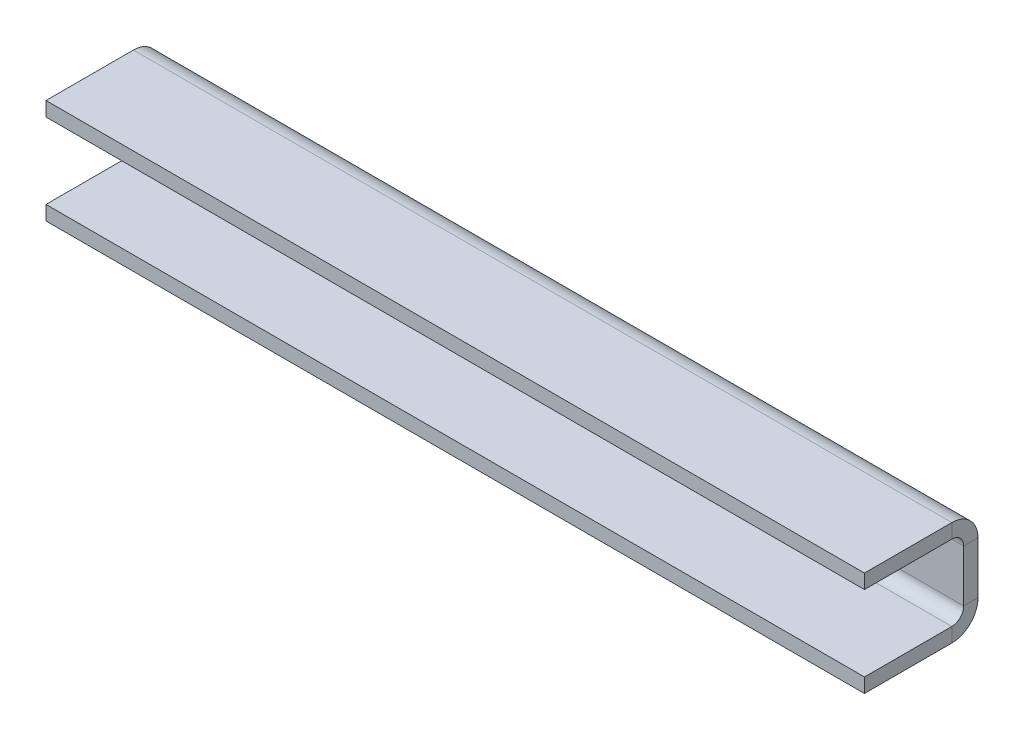
ISO-10303-21;
HEADER;
FILE_DESCRIPTION(('STEP AP214'),'2;1');
FILE_NAME('part.step','',(''),(''),'','','');
FILE_SCHEMA(('AUTOMOTIVE_DESIGN { 1 0 10303 214 1 1 1 1 }'));
ENDSEC;
DATA;
#1=APPLICATION_CONTEXT('core data for automotive mechanical design processes');
#2=APPLICATION_PROTOCOL_DEFINITION('international standard','automotive_design',2000,#1);
#3=PRODUCT_CONTEXT('',#1,'mechanical');
#4=PRODUCT('Part','Part','',(#3));
#5=PRODUCT_RELATED_PRODUCT_CATEGORY('part','',(#4));
#6=PRODUCT_DEFINITION_FORMATION('','',#4);
#7=PRODUCT_DEFINITION_CONTEXT('part definition',#1,'design');
#8=PRODUCT_DEFINITION('design','',#6,#7);
#9=PRODUCT_DEFINITION_SHAPE('','',#8);
#10=(LENGTH_UNIT() NAMED_UNIT(*) SI_UNIT(.MILLI.,.METRE.));
#11=(NAMED_UNIT(*) PLANE_ANGLE_UNIT() SI_UNIT($,.RADIAN.));
#12=(NAMED_UNIT(*) SI_UNIT($,.STERADIAN.) SOLID_ANGLE_UNIT());
#13=UNCERTAINTY_MEASURE_WITH_UNIT(LENGTH_MEASURE(1.E-05),#10,'distance_accuracy_value','');
#14=(GEOMETRIC_REPRESENTATION_CONTEXT(3) GLOBAL_UNCERTAINTY_ASSIGNED_CONTEXT((#13)) GLOBAL_UNIT_ASSIGNED_CONTEXT((#10,
#11,#12)) REPRESENTATION_CONTEXT('',''));
#15=CARTESIAN_POINT('',(0.,0.,0.));
#16=DIRECTION('',(0.,0.,1.));
#17=DIRECTION('',(1.,0.,0.));
#18=AXIS2_PLACEMENT_3D('',#15,#16,#17);
#19=CARTESIAN_POINT('',(0.,0.,0.));
#20=DIRECTION('',(0.,0.,-1.));
#21=DIRECTION('',(-1.,0.,0.));
#22=AXIS2_PLACEMENT_3D('',#19,#20,#21);
#23=PLANE('',#22);
#24=CARTESIAN_POINT('',(12.7,0.,0.));
#25=DIRECTION('',(0.,0.,-1.));
#26=DIRECTION('',(-1.,0.,0.));
#27=AXIS2_PLACEMENT_3D('',#24,#25,#26);
#28=CIRCLE('',#27,1.27);
#29=CARTESIAN_POINT('',(11.43,0.,0.));
#30=VERTEX_POINT('',#29);
#31=EDGE_CURVE('E332',#30,#30,#28,.T.);
#32=ORIENTED_EDGE('',*,*,#31,.T.);
#33=EDGE_LOOP('',(#32));
#34=FACE_BOUND('',#33,.T.);
#35=CARTESIAN_POINT('',(-12.7,0.,0.));
#36=DIRECTION('',(0.,0.,-1.));
#37=DIRECTION('',(-1.,0.,0.));
#38=AXIS2_PLACEMENT_3D('',#35,#36,#37);
#39=CIRCLE('',#38,1.27);
#40=CARTESIAN_POINT('',(-13.97,0.,0.));
#41=VERTEX_POINT('',#40);
#42=EDGE_CURVE('E185',#41,#41,#39,.T.);
#43=ORIENTED_EDGE('',*,*,#42,.T.);
#44=EDGE_LOOP('',(#43));
#45=FACE_BOUND('',#44,.T.);
#46=DIRECTION('',(0.,-1.,0.));
#47=VECTOR('',#46,1.);
#48=CARTESIAN_POINT('',(-25.4,-8.89,0.));
#49=LINE('',#48,#47);
#50=CARTESIAN_POINT('',(-25.4,1.61236622921128,0.));
#51=VERTEX_POINT('',#50);
#52=CARTESIAN_POINT('',(-25.4,-1.61236622921127,0.));
#53=VERTEX_POINT('',#52);
#54=EDGE_CURVE('E80',#51,#53,#49,.T.);
#55=ORIENTED_EDGE('',*,*,#54,.T.);
#56=DIRECTION('',(1.,0.,0.));
#57=VECTOR('',#56,1.);
#58=CARTESIAN_POINT('',(0.,-1.61236622921127,0.));
#59=LINE('',#58,#57);
#60=CARTESIAN_POINT('',(25.4,-1.61236622921127,0.));
#61=VERTEX_POINT('',#60);
#62=EDGE_CURVE('E72',#53,#61,#59,.T.);
#63=ORIENTED_EDGE('',*,*,#62,.T.);
#64=DIRECTION('',(0.,1.,0.));
#65=VECTOR('',#64,1.);
#66=CARTESIAN_POINT('',(25.4,-8.89,0.));
#67=LINE('',#66,#65);
#68=CARTESIAN_POINT('',(25.4,1.61236622921127,0.));
#69=VERTEX_POINT('',#68);
#70=EDGE_CURVE('E88',#61,#69,#67,.T.);
#71=ORIENTED_EDGE('',*,*,#70,.T.);
#72=DIRECTION('',(1.,0.,0.));
#73=VECTOR('',#72,1.);
#74=CARTESIAN_POINT('',(0.,1.61236622921127,0.));
#75=LINE('',#74,#73);
#76=EDGE_CURVE('E208',#51,#69,#75,.T.);
#77=ORIENTED_EDGE('',*,*,#76,.F.);
#78=EDGE_LOOP('',(#55,#63,#71,#77));
#79=FACE_BOUND('',#78,.T.);
#80=ADVANCED_FACE('F63',(#34,#45,#79),#23,.F.);
#81=CARTESIAN_POINT('',(0.,2.34896622921128,-2.73103377078873));
#82=DIRECTION('',(0.,1.,0.));
#83=DIRECTION('',(-1.,0.,0.));
#84=AXIS2_PLACEMENT_3D('',#81,#82,#83);
#85=PLANE('',#84);
#86=DIRECTION('',(0.,0.,-1.));
#87=VECTOR('',#86,1.);
#88=CARTESIAN_POINT('',(-25.4,2.34896622921131,-11.6210337707887));
#89=LINE('',#88,#87);
#90=CARTESIAN_POINT('',(-25.4,2.34896622921125,6.15896622921127));
#91=VERTEX_POINT('',#90);
#92=CARTESIAN_POINT('',(-25.4,2.34896622921128,0.736599999999997));
#93=VERTEX_POINT('',#92);
#94=EDGE_CURVE('E232',#91,#93,#89,.T.);
#95=ORIENTED_EDGE('',*,*,#94,.T.);
#96=DIRECTION('',(1.,0.,0.));
#97=VECTOR('',#96,1.);
#98=CARTESIAN_POINT('',(0.,2.34896622921128,0.736599999999997));
#99=LINE('',#98,#97);
#100=CARTESIAN_POINT('',(25.4,2.34896622921128,0.736600000000011));
#101=VERTEX_POINT('',#100);
#102=EDGE_CURVE('E245',#93,#101,#99,.T.);
#103=ORIENTED_EDGE('',*,*,#102,.T.);
#104=DIRECTION('',(0.,0.,1.));
#105=VECTOR('',#104,1.);
#106=CARTESIAN_POINT('',(25.4,2.34896622921131,-11.6210337707887));
#107=LINE('',#106,#105);
#108=CARTESIAN_POINT('',(25.4,2.34896622921125,6.15896622921128));
#109=VERTEX_POINT('',#108);
#110=EDGE_CURVE('E233',#101,#109,#107,.T.);
#111=ORIENTED_EDGE('',*,*,#110,.T.);
#112=DIRECTION('',(-1.,0.,0.));
#113=VECTOR('',#112,1.);
#114=CARTESIAN_POINT('',(-25.4,2.34896622921125,6.15896622921127));
#115=LINE('',#114,#113);
#116=EDGE_CURVE('E229',#109,#91,#115,.T.);
#117=ORIENTED_EDGE('',*,*,#116,.T.);
#118=EDGE_LOOP('',(#95,#103,#111,#117));
#119=FACE_BOUND('',#118,.T.);
#120=ADVANCED_FACE('F290',(#119),#85,.F.);
#121=CARTESIAN_POINT('',(25.4,3.23796622921131,-11.6210337707887));
#122=DIRECTION('',(1.,0.,0.));
#123=DIRECTION('',(0.,1.,0.));
#124=AXIS2_PLACEMENT_3D('',#121,#122,#123);
#125=PLANE('',#124);
#126=DIRECTION('',(0.,-1.,0.));
#127=VECTOR('',#126,1.);
#128=CARTESIAN_POINT('',(25.4,3.23796622921119,0.736600000000018));
#129=LINE('',#128,#127);
#130=CARTESIAN_POINT('',(25.4,3.23796622921128,0.736600000000018));
#131=VERTEX_POINT('',#130);
#132=EDGE_CURVE('E242',#131,#101,#129,.T.);
#133=ORIENTED_EDGE('',*,*,#132,.F.);
#134=DIRECTION('',(0.,0.,1.));
#135=VECTOR('',#134,1.);
#136=CARTESIAN_POINT('',(25.4,3.23796622921131,-11.6210337707887));
#137=LINE('',#136,#135);
#138=CARTESIAN_POINT('',(25.4,3.23796622921125,6.15896622921128));
#139=VERTEX_POINT('',#138);
#140=EDGE_CURVE('E228',#131,#139,#137,.T.);
#141=ORIENTED_EDGE('',*,*,#140,.T.);
#142=DIRECTION('',(0.,-1.,0.));
#143=VECTOR('',#142,1.);
#144=CARTESIAN_POINT('',(25.4,3.23796622921125,6.15896622921128));
#145=LINE('',#144,#143);
#146=EDGE_CURVE('E237',#139,#109,#145,.T.);
#147=ORIENTED_EDGE('',*,*,#146,.T.);
#148=ORIENTED_EDGE('',*,*,#110,.F.);
#149=EDGE_LOOP('',(#133,#141,#147,#148));
#150=FACE_BOUND('',#149,.T.);
#151=ADVANCED_FACE('F300',(#150),#125,.T.);
#152=CARTESIAN_POINT('',(-25.4,3.23796622921131,-11.6210337707887));
#153=DIRECTION('',(-1.,0.,0.));
#154=DIRECTION('',(0.,-1.,0.));
#155=AXIS2_PLACEMENT_3D('',#152,#153,#154);
#156=PLANE('',#155);
#157=DIRECTION('',(0.,1.,0.));
#158=VECTOR('',#157,1.);
#159=CARTESIAN_POINT('',(-25.4,3.23796622921119,0.73660000000001));
#160=LINE('',#159,#158);
#161=CARTESIAN_POINT('',(-25.4,3.23796622921128,0.736600000000003));
#162=VERTEX_POINT('',#161);
#163=EDGE_CURVE('E248',#93,#162,#160,.T.);
#164=ORIENTED_EDGE('',*,*,#163,.F.);
#165=ORIENTED_EDGE('',*,*,#94,.F.);
#166=DIRECTION('',(0.,-1.,0.));
#167=VECTOR('',#166,1.);
#168=CARTESIAN_POINT('',(-25.4,3.23796622921125,6.15896622921127));
#169=LINE('',#168,#167);
#170=CARTESIAN_POINT('',(-25.4,3.23796622921125,6.15896622921127));
#171=VERTEX_POINT('',#170);
#172=EDGE_CURVE('E234',#171,#91,#169,.T.);
#173=ORIENTED_EDGE('',*,*,#172,.F.);
#174=DIRECTION('',(0.,0.,-1.));
#175=VECTOR('',#174,1.);
#176=CARTESIAN_POINT('',(-25.4,3.23796622921131,-11.6210337707887));
#177=LINE('',#176,#175);
#178=EDGE_CURVE('E227',#171,#162,#177,.T.);
#179=ORIENTED_EDGE('',*,*,#178,.T.);
#180=EDGE_LOOP('',(#164,#165,#173,#179));
#181=FACE_BOUND('',#180,.T.);
#182=ADVANCED_FACE('F287',(#181),#156,.T.);
#183=CARTESIAN_POINT('',(-25.4,3.23796622921125,6.15896622921127));
#184=DIRECTION('',(0.,0.,1.));
#185=DIRECTION('',(0.,-1.,0.));
#186=AXIS2_PLACEMENT_3D('',#183,#184,#185);
#187=PLANE('',#186);
#188=ORIENTED_EDGE('',*,*,#116,.F.);
#189=ORIENTED_EDGE('',*,*,#146,.F.);
#190=DIRECTION('',(-1.,0.,0.));
#191=VECTOR('',#190,1.);
#192=CARTESIAN_POINT('',(-25.4,3.23796622921125,6.15896622921127));
#193=LINE('',#192,#191);
#194=EDGE_CURVE('E224',#139,#171,#193,.T.);
#195=ORIENTED_EDGE('',*,*,#194,.T.);
#196=ORIENTED_EDGE('',*,*,#172,.T.);
#197=EDGE_LOOP('',(#188,#189,#195,#196));
#198=FACE_BOUND('',#197,.T.);
#199=ADVANCED_FACE('F294',(#198),#187,.T.);
#200=CARTESIAN_POINT('',(0.,3.23796622921128,-2.73103377078873));
#201=DIRECTION('',(0.,1.,0.));
#202=DIRECTION('',(-1.,0.,0.));
#203=AXIS2_PLACEMENT_3D('',#200,#201,#202);
#204=PLANE('',#203);
#205=DIRECTION('',(1.,0.,0.));
#206=VECTOR('',#205,1.);
#207=CARTESIAN_POINT('',(0.,3.23796622921128,0.736600000000011));
#208=LINE('',#207,#206);
#209=EDGE_CURVE('E236',#162,#131,#208,.T.);
#210=ORIENTED_EDGE('',*,*,#209,.F.);
#211=ORIENTED_EDGE('',*,*,#178,.F.);
#212=ORIENTED_EDGE('',*,*,#194,.F.);
#213=ORIENTED_EDGE('',*,*,#140,.F.);
#214=EDGE_LOOP('',(#210,#211,#212,#213));
#215=FACE_BOUND('',#214,.T.);
#216=ADVANCED_FACE('F297',(#215),#204,.T.);
#217=CARTESIAN_POINT('',(0.,0.,-0.889000000000001));
#218=DIRECTION('',(0.,0.,-1.));
#219=DIRECTION('',(-1.,0.,0.));
#220=AXIS2_PLACEMENT_3D('',#217,#218,#219);
#221=PLANE('',#220);
#222=CARTESIAN_POINT('',(12.7,0.,-0.889000000000001));
#223=DIRECTION('',(0.,0.,-1.));
#224=DIRECTION('',(-1.,0.,0.));
#225=AXIS2_PLACEMENT_3D('',#222,#223,#224);
#226=CIRCLE('',#225,1.27);
#227=CARTESIAN_POINT('',(11.43,0.,-0.889000000000001));
#228=VERTEX_POINT('',#227);
#229=EDGE_CURVE('E327',#228,#228,#226,.T.);
#230=ORIENTED_EDGE('',*,*,#229,.F.);
#231=EDGE_LOOP('',(#230));
#232=FACE_BOUND('',#231,.T.);
#233=CARTESIAN_POINT('',(-12.7,0.,-0.889000000000001));
#234=DIRECTION('',(0.,0.,-1.));
#235=DIRECTION('',(-1.,0.,0.));
#236=AXIS2_PLACEMENT_3D('',#233,#234,#235);
#237=CIRCLE('',#236,1.27);
#238=CARTESIAN_POINT('',(-13.97,0.,-0.889000000000001));
#239=VERTEX_POINT('',#238);
#240=EDGE_CURVE('E330',#239,#239,#237,.T.);
#241=ORIENTED_EDGE('',*,*,#240,.F.);
#242=EDGE_LOOP('',(#241));
#243=FACE_BOUND('',#242,.T.);
#244=DIRECTION('',(1.,0.,0.));
#245=VECTOR('',#244,1.);
#246=CARTESIAN_POINT('',(0.,-1.61236622921127,-0.888999999999987));
#247=LINE('',#246,#245);
#248=CARTESIAN_POINT('',(-25.4,-1.61236622921127,-0.888999999999994));
#249=VERTEX_POINT('',#248);
#250=CARTESIAN_POINT('',(25.4,-1.61236622921127,-0.888999999999987));
#251=VERTEX_POINT('',#250);
#252=EDGE_CURVE('E251',#249,#251,#247,.T.);
#253=ORIENTED_EDGE('',*,*,#252,.F.);
#254=DIRECTION('',(0.,-1.,0.));
#255=VECTOR('',#254,1.);
#256=CARTESIAN_POINT('',(-25.4,-8.89,-0.888999999999997));
#257=LINE('',#256,#255);
#258=CARTESIAN_POINT('',(-25.4,1.61236622921128,-0.889000000000001));
#259=VERTEX_POINT('',#258);
#260=EDGE_CURVE('E216',#259,#249,#257,.T.);
#261=ORIENTED_EDGE('',*,*,#260,.F.);
#262=DIRECTION('',(1.,0.,0.));
#263=VECTOR('',#262,1.);
#264=CARTESIAN_POINT('',(0.,1.61236622921128,-0.889000000000001));
#265=LINE('',#264,#263);
#266=CARTESIAN_POINT('',(25.4,1.61236622921128,-0.888999999999987));
#267=VERTEX_POINT('',#266);
#268=EDGE_CURVE('E219',#259,#267,#265,.T.);
#269=ORIENTED_EDGE('',*,*,#268,.T.);
#270=DIRECTION('',(0.,1.,0.));
#271=VECTOR('',#270,1.);
#272=CARTESIAN_POINT('',(25.4,-8.89,-0.888999999999987));
#273=LINE('',#272,#271);
#274=EDGE_CURVE('E67',#251,#267,#273,.T.);
#275=ORIENTED_EDGE('',*,*,#274,.F.);
#276=EDGE_LOOP('',(#253,#261,#269,#275));
#277=FACE_BOUND('',#276,.T.);
#278=ADVANCED_FACE('F277',(#232,#243,#277),#221,.T.);
#279=CARTESIAN_POINT('',(25.4,-8.89,-0.888999999999987));
#280=DIRECTION('',(1.,0.,0.));
#281=DIRECTION('',(0.,0.,-1.));
#282=AXIS2_PLACEMENT_3D('',#279,#280,#281);
#283=PLANE('',#282);
#284=DIRECTION('',(0.,0.,1.));
#285=VECTOR('',#284,1.);
#286=CARTESIAN_POINT('',(25.4,-1.61236622921127,-0.888999999999932));
#287=LINE('',#286,#285);
#288=EDGE_CURVE('E259',#251,#61,#287,.T.);
#289=ORIENTED_EDGE('',*,*,#288,.F.);
#290=ORIENTED_EDGE('',*,*,#274,.T.);
#291=DIRECTION('',(0.,0.,1.));
#292=VECTOR('',#291,1.);
#293=CARTESIAN_POINT('',(25.4,1.61236622921128,-0.888999999999918));
#294=LINE('',#293,#292);
#295=EDGE_CURVE('E217',#267,#69,#294,.T.);
#296=ORIENTED_EDGE('',*,*,#295,.T.);
#297=ORIENTED_EDGE('',*,*,#70,.F.);
#298=EDGE_LOOP('',(#289,#290,#296,#297));
#299=FACE_BOUND('',#298,.T.);
#300=ADVANCED_FACE('F274',(#299),#283,.T.);
#301=CARTESIAN_POINT('',(-25.4,-8.89,-0.888999999999997));
#302=DIRECTION('',(-1.,0.,0.));
#303=DIRECTION('',(0.,0.,1.));
#304=AXIS2_PLACEMENT_3D('',#301,#302,#303);
#305=PLANE('',#304);
#306=DIRECTION('',(0.,0.,-1.));
#307=VECTOR('',#306,1.);
#308=CARTESIAN_POINT('',(-25.4,-1.61236622921127,-0.888999999999945));
#309=LINE('',#308,#307);
#310=EDGE_CURVE('E14',#53,#249,#309,.T.);
#311=ORIENTED_EDGE('',*,*,#310,.F.);
#312=ORIENTED_EDGE('',*,*,#54,.F.);
#313=DIRECTION('',(0.,0.,-1.));
#314=VECTOR('',#313,1.);
#315=CARTESIAN_POINT('',(-25.4,1.61236622921128,-0.888999999999925));
#316=LINE('',#315,#314);
#317=EDGE_CURVE('E213',#51,#259,#316,.T.);
#318=ORIENTED_EDGE('',*,*,#317,.T.);
#319=ORIENTED_EDGE('',*,*,#260,.T.);
#320=EDGE_LOOP('',(#311,#312,#318,#319));
#321=FACE_BOUND('',#320,.T.);
#322=ADVANCED_FACE('F65',(#321),#305,.T.);
#323=CARTESIAN_POINT('',(-25.4,1.61236622921128,0.736599999999995));
#324=DIRECTION('',(-1.,0.,0.));
#325=DIRECTION('',(0.,0.,1.));
#326=AXIS2_PLACEMENT_3D('',#323,#324,#325);
#327=PLANE('',#326);
#328=ORIENTED_EDGE('',*,*,#317,.F.);
#329=CARTESIAN_POINT('',(-25.4,1.61236622921128,0.736599999999995));
#330=DIRECTION('',(1.,0.,0.));
#331=DIRECTION('',(0.,0.,-1.));
#332=AXIS2_PLACEMENT_3D('',#329,#330,#331);
#333=CIRCLE('',#332,0.7366);
#334=EDGE_CURVE('E196',#51,#93,#333,.T.);
#335=ORIENTED_EDGE('',*,*,#334,.T.);
#336=ORIENTED_EDGE('',*,*,#163,.T.);
#337=CARTESIAN_POINT('',(-25.4,1.61236622921128,0.736599999999995));
#338=DIRECTION('',(1.,0.,0.));
#339=DIRECTION('',(0.,0.,1.));
#340=AXIS2_PLACEMENT_3D('',#337,#338,#339);
#341=CIRCLE('',#340,1.6256);
#342=EDGE_CURVE('E201',#259,#162,#341,.T.);
#343=ORIENTED_EDGE('',*,*,#342,.F.);
#344=EDGE_LOOP('',(#328,#335,#336,#343));
#345=FACE_BOUND('',#344,.T.);
#346=ADVANCED_FACE('F283',(#345),#327,.T.);
#347=CARTESIAN_POINT('',(25.4,1.61236622921128,0.736600000000002));
#348=DIRECTION('',(1.,0.,0.));
#349=DIRECTION('',(0.,0.,-1.));
#350=AXIS2_PLACEMENT_3D('',#347,#348,#349);
#351=PLANE('',#350);
#352=CARTESIAN_POINT('',(25.4,1.61236622921128,0.736600000000002));
#353=DIRECTION('',(1.,0.,0.));
#354=DIRECTION('',(0.,0.,-1.));
#355=AXIS2_PLACEMENT_3D('',#352,#353,#354);
#356=CIRCLE('',#355,0.7366);
#357=EDGE_CURVE('E205',#101,#69,#356,.F.);
#358=ORIENTED_EDGE('',*,*,#357,.T.);
#359=ORIENTED_EDGE('',*,*,#295,.F.);
#360=CARTESIAN_POINT('',(25.4,1.61236622921128,0.736600000000002));
#361=DIRECTION('',(-1.,0.,0.));
#362=DIRECTION('',(0.,0.,-1.));
#363=AXIS2_PLACEMENT_3D('',#360,#361,#362);
#364=CIRCLE('',#363,1.6256);
#365=EDGE_CURVE('E204',#131,#267,#364,.T.);
#366=ORIENTED_EDGE('',*,*,#365,.F.);
#367=ORIENTED_EDGE('',*,*,#132,.T.);
#368=EDGE_LOOP('',(#358,#359,#366,#367));
#369=FACE_BOUND('',#368,.T.);
#370=ADVANCED_FACE('F268',(#369),#351,.T.);
#371=CARTESIAN_POINT('',(-50.8416398107971,1.61236622921128,0.736600000000002));
#372=DIRECTION('',(1.,0.,0.));
#373=DIRECTION('',(0.,0.,-1.));
#374=AXIS2_PLACEMENT_3D('',#371,#372,#373);
#375=CYLINDRICAL_SURFACE('',#374,1.6256);
#376=ORIENTED_EDGE('',*,*,#209,.T.);
#377=ORIENTED_EDGE('',*,*,#365,.T.);
#378=ORIENTED_EDGE('',*,*,#268,.F.);
#379=ORIENTED_EDGE('',*,*,#342,.T.);
#380=EDGE_LOOP('',(#376,#377,#378,#379));
#381=FACE_BOUND('',#380,.T.);
#382=ADVANCED_FACE('F281',(#381),#375,.T.);
#383=CARTESIAN_POINT('',(-50.8416398107971,1.61236622921128,0.736600000000002));
#384=DIRECTION('',(1.,0.,0.));
#385=DIRECTION('',(0.,0.,-1.));
#386=AXIS2_PLACEMENT_3D('',#383,#384,#385);
#387=CYLINDRICAL_SURFACE('',#386,0.7366);
#388=ORIENTED_EDGE('',*,*,#102,.F.);
#389=ORIENTED_EDGE('',*,*,#334,.F.);
#390=ORIENTED_EDGE('',*,*,#76,.T.);
#391=ORIENTED_EDGE('',*,*,#357,.F.);
#392=EDGE_LOOP('',(#388,#389,#390,#391));
#393=FACE_BOUND('',#392,.T.);
#394=ADVANCED_FACE('F273',(#393),#387,.F.);
#395=CARTESIAN_POINT('',(-25.4,-1.61236622921127,0.736600000000002));
#396=DIRECTION('',(-1.,0.,0.));
#397=DIRECTION('',(0.,0.,1.));
#398=AXIS2_PLACEMENT_3D('',#395,#396,#397);
#399=PLANE('',#398);
#400=DIRECTION('',(0.,-1.,0.));
#401=VECTOR('',#400,1.);
#402=CARTESIAN_POINT('',(-25.4,-3.23796622921123,0.736600000000009));
#403=LINE('',#402,#401);
#404=CARTESIAN_POINT('',(-25.4,-2.34896622921127,0.736600000000009));
#405=VERTEX_POINT('',#404);
#406=CARTESIAN_POINT('',(-25.4,-3.23796622921127,0.736600000000002));
#407=VERTEX_POINT('',#406);
#408=EDGE_CURVE('E162',#405,#407,#403,.T.);
#409=ORIENTED_EDGE('',*,*,#408,.F.);
#410=CARTESIAN_POINT('',(-25.4,-1.61236622921127,0.736600000000002));
#411=DIRECTION('',(-1.,0.,0.));
#412=DIRECTION('',(0.,0.,1.));
#413=AXIS2_PLACEMENT_3D('',#410,#411,#412);
#414=CIRCLE('',#413,0.7366);
#415=EDGE_CURVE('E173',#405,#53,#414,.F.);
#416=ORIENTED_EDGE('',*,*,#415,.T.);
#417=ORIENTED_EDGE('',*,*,#310,.T.);
#418=CARTESIAN_POINT('',(-25.4,-1.61236622921127,0.736600000000002));
#419=DIRECTION('',(1.,0.,0.));
#420=DIRECTION('',(0.,0.,1.));
#421=AXIS2_PLACEMENT_3D('',#418,#419,#420);
#422=CIRCLE('',#421,1.6256);
#423=EDGE_CURVE('E189',#407,#249,#422,.T.);
#424=ORIENTED_EDGE('',*,*,#423,.F.);
#425=EDGE_LOOP('',(#409,#416,#417,#424));
#426=FACE_BOUND('',#425,.T.);
#427=ADVANCED_FACE('F360',(#426),#399,.T.);
#428=CARTESIAN_POINT('',(25.4,-1.61236622921127,0.736600000000016));
#429=DIRECTION('',(1.,0.,0.));
#430=DIRECTION('',(0.,0.,-1.));
#431=AXIS2_PLACEMENT_3D('',#428,#429,#430);
#432=PLANE('',#431);
#433=CARTESIAN_POINT('',(25.4,-1.61236622921127,0.736600000000016));
#434=DIRECTION('',(-1.,0.,0.));
#435=DIRECTION('',(0.,0.,1.));
#436=AXIS2_PLACEMENT_3D('',#433,#434,#435);
#437=CIRCLE('',#436,0.7366);
#438=CARTESIAN_POINT('',(25.4,-2.34896622921127,0.736600000000023));
#439=VERTEX_POINT('',#438);
#440=EDGE_CURVE('E193',#61,#439,#437,.T.);
#441=ORIENTED_EDGE('',*,*,#440,.T.);
#442=DIRECTION('',(0.,1.,0.));
#443=VECTOR('',#442,1.);
#444=CARTESIAN_POINT('',(25.4,-3.23796622921123,0.736600000000018));
#445=LINE('',#444,#443);
#446=CARTESIAN_POINT('',(25.4,-3.23796622921126,0.736600000000018));
#447=VERTEX_POINT('',#446);
#448=EDGE_CURVE('E345',#447,#439,#445,.T.);
#449=ORIENTED_EDGE('',*,*,#448,.F.);
#450=CARTESIAN_POINT('',(25.4,-1.61236622921127,0.736600000000016));
#451=DIRECTION('',(-1.,0.,0.));
#452=DIRECTION('',(0.,0.,-1.));
#453=AXIS2_PLACEMENT_3D('',#450,#451,#452);
#454=CIRCLE('',#453,1.6256);
#455=EDGE_CURVE('E192',#251,#447,#454,.T.);
#456=ORIENTED_EDGE('',*,*,#455,.F.);
#457=ORIENTED_EDGE('',*,*,#288,.T.);
#458=EDGE_LOOP('',(#441,#449,#456,#457));
#459=FACE_BOUND('',#458,.T.);
#460=ADVANCED_FACE('F356',(#459),#432,.T.);
#461=CARTESIAN_POINT('',(50.8416398107971,-1.61236622921127,0.736600000000004));
#462=DIRECTION('',(-1.,0.,0.));
#463=DIRECTION('',(0.,0.,1.));
#464=AXIS2_PLACEMENT_3D('',#461,#462,#463);
#465=CYLINDRICAL_SURFACE('',#464,1.6256);
#466=ORIENTED_EDGE('',*,*,#252,.T.);
#467=ORIENTED_EDGE('',*,*,#455,.T.);
#468=DIRECTION('',(1.,0.,0.));
#469=VECTOR('',#468,1.);
#470=CARTESIAN_POINT('',(0.,-3.23796622921126,0.736600000000018));
#471=LINE('',#470,#469);
#472=EDGE_CURVE('E182',#407,#447,#471,.T.);
#473=ORIENTED_EDGE('',*,*,#472,.F.);
#474=ORIENTED_EDGE('',*,*,#423,.T.);
#475=EDGE_LOOP('',(#466,#467,#473,#474));
#476=FACE_BOUND('',#475,.T.);
#477=ADVANCED_FACE('F358',(#476),#465,.T.);
#478=CARTESIAN_POINT('',(50.8416398107971,-1.61236622921127,0.736600000000004));
#479=DIRECTION('',(-1.,0.,0.));
#480=DIRECTION('',(0.,0.,1.));
#481=AXIS2_PLACEMENT_3D('',#478,#479,#480);
#482=CYLINDRICAL_SURFACE('',#481,0.7366);
#483=ORIENTED_EDGE('',*,*,#62,.F.);
#484=ORIENTED_EDGE('',*,*,#415,.F.);
#485=DIRECTION('',(1.,0.,0.));
#486=VECTOR('',#485,1.);
#487=CARTESIAN_POINT('',(0.,-2.34896622921127,0.736600000000025));
#488=LINE('',#487,#486);
#489=EDGE_CURVE('E180',#405,#439,#488,.T.);
#490=ORIENTED_EDGE('',*,*,#489,.T.);
#491=ORIENTED_EDGE('',*,*,#440,.F.);
#492=EDGE_LOOP('',(#483,#484,#490,#491));
#493=FACE_BOUND('',#492,.T.);
#494=ADVANCED_FACE('F364',(#493),#482,.F.);
#495=CARTESIAN_POINT('',(-25.4,-3.23796622921126,6.15896622921128));
#496=DIRECTION('',(0.,0.,1.));
#497=DIRECTION('',(0.,-1.,0.));
#498=AXIS2_PLACEMENT_3D('',#495,#496,#497);
#499=PLANE('',#498);
#500=DIRECTION('',(1.,0.,0.));
#501=VECTOR('',#500,1.);
#502=CARTESIAN_POINT('',(-25.4,-2.34896622921126,6.15896622921128));
#503=LINE('',#502,#501);
#504=CARTESIAN_POINT('',(-25.4,-2.34896622921126,6.15896622921128));
#505=VERTEX_POINT('',#504);
#506=CARTESIAN_POINT('',(25.4,-2.34896622921126,6.15896622921129));
#507=VERTEX_POINT('',#506);
#508=EDGE_CURVE('E172',#505,#507,#503,.T.);
#509=ORIENTED_EDGE('',*,*,#508,.F.);
#510=DIRECTION('',(0.,1.,0.));
#511=VECTOR('',#510,1.);
#512=CARTESIAN_POINT('',(-25.4,-3.23796622921126,6.15896622921128));
#513=LINE('',#512,#511);
#514=CARTESIAN_POINT('',(-25.4,-3.23796622921126,6.15896622921128));
#515=VERTEX_POINT('',#514);
#516=EDGE_CURVE('E159',#515,#505,#513,.T.);
#517=ORIENTED_EDGE('',*,*,#516,.F.);
#518=DIRECTION('',(1.,0.,0.));
#519=VECTOR('',#518,1.);
#520=CARTESIAN_POINT('',(-25.4,-3.23796622921126,6.15896622921128));
#521=LINE('',#520,#519);
#522=CARTESIAN_POINT('',(25.4,-3.23796622921126,6.1589662292113));
#523=VERTEX_POINT('',#522);
#524=EDGE_CURVE('E170',#515,#523,#521,.T.);
#525=ORIENTED_EDGE('',*,*,#524,.T.);
#526=DIRECTION('',(0.,1.,0.));
#527=VECTOR('',#526,1.);
#528=CARTESIAN_POINT('',(25.4,-3.23796622921126,6.1589662292113));
#529=LINE('',#528,#527);
#530=EDGE_CURVE('E179',#523,#507,#529,.T.);
#531=ORIENTED_EDGE('',*,*,#530,.T.);
#532=EDGE_LOOP('',(#509,#517,#525,#531));
#533=FACE_BOUND('',#532,.T.);
#534=ADVANCED_FACE('F169',(#533),#499,.T.);
#535=CARTESIAN_POINT('',(0.,-3.23796622921129,-2.7310337707887));
#536=DIRECTION('',(0.,-1.,0.));
#537=DIRECTION('',(-1.,0.,0.));
#538=AXIS2_PLACEMENT_3D('',#535,#536,#537);
#539=PLANE('',#538);
#540=DIRECTION('',(0.,0.,1.));
#541=VECTOR('',#540,1.);
#542=CARTESIAN_POINT('',(-25.4,-3.23796622921126,6.15896622921128));
#543=LINE('',#542,#541);
#544=EDGE_CURVE('E156',#407,#515,#543,.T.);
#545=ORIENTED_EDGE('',*,*,#544,.F.);
#546=ORIENTED_EDGE('',*,*,#472,.T.);
#547=DIRECTION('',(0.,0.,-1.));
#548=VECTOR('',#547,1.);
#549=CARTESIAN_POINT('',(25.4,-3.23796622921126,6.1589662292113));
#550=LINE('',#549,#548);
#551=EDGE_CURVE('E178',#523,#447,#550,.T.);
#552=ORIENTED_EDGE('',*,*,#551,.F.);
#553=ORIENTED_EDGE('',*,*,#524,.F.);
#554=EDGE_LOOP('',(#545,#546,#552,#553));
#555=FACE_BOUND('',#554,.T.);
#556=ADVANCED_FACE('F176',(#555),#539,.T.);
#557=CARTESIAN_POINT('',(25.4,-3.23796622921126,6.1589662292113));
#558=DIRECTION('',(1.,0.,0.));
#559=DIRECTION('',(0.,-1.,0.));
#560=AXIS2_PLACEMENT_3D('',#557,#558,#559);
#561=PLANE('',#560);
#562=ORIENTED_EDGE('',*,*,#551,.T.);
#563=ORIENTED_EDGE('',*,*,#448,.T.);
#564=DIRECTION('',(0.,0.,-1.));
#565=VECTOR('',#564,1.);
#566=CARTESIAN_POINT('',(25.4,-2.34896622921126,6.15896622921129));
#567=LINE('',#566,#565);
#568=EDGE_CURVE('E340',#507,#439,#567,.T.);
#569=ORIENTED_EDGE('',*,*,#568,.F.);
#570=ORIENTED_EDGE('',*,*,#530,.F.);
#571=EDGE_LOOP('',(#562,#563,#569,#570));
#572=FACE_BOUND('',#571,.T.);
#573=ADVANCED_FACE('F352',(#572),#561,.T.);
#574=CARTESIAN_POINT('',(0.,-2.34896622921129,-2.7310337707887));
#575=DIRECTION('',(0.,-1.,0.));
#576=DIRECTION('',(-1.,0.,0.));
#577=AXIS2_PLACEMENT_3D('',#574,#575,#576);
#578=PLANE('',#577);
#579=ORIENTED_EDGE('',*,*,#489,.F.);
#580=DIRECTION('',(0.,0.,1.));
#581=VECTOR('',#580,1.);
#582=CARTESIAN_POINT('',(-25.4,-2.34896622921126,6.15896622921128));
#583=LINE('',#582,#581);
#584=EDGE_CURVE('E343',#405,#505,#583,.T.);
#585=ORIENTED_EDGE('',*,*,#584,.T.);
#586=ORIENTED_EDGE('',*,*,#508,.T.);
#587=ORIENTED_EDGE('',*,*,#568,.T.);
#588=EDGE_LOOP('',(#579,#585,#586,#587));
#589=FACE_BOUND('',#588,.T.);
#590=ADVANCED_FACE('F367',(#589),#578,.F.);
#591=CARTESIAN_POINT('',(-25.4,-3.23796622921126,6.15896622921128));
#592=DIRECTION('',(-1.,0.,0.));
#593=DIRECTION('',(0.,1.,0.));
#594=AXIS2_PLACEMENT_3D('',#591,#592,#593);
#595=PLANE('',#594);
#596=ORIENTED_EDGE('',*,*,#584,.F.);
#597=ORIENTED_EDGE('',*,*,#408,.T.);
#598=ORIENTED_EDGE('',*,*,#544,.T.);
#599=ORIENTED_EDGE('',*,*,#516,.T.);
#600=EDGE_LOOP('',(#596,#597,#598,#599));
#601=FACE_BOUND('',#600,.T.);
#602=ADVANCED_FACE('F158',(#601),#595,.T.);
#603=CARTESIAN_POINT('',(-12.7,0.,-0.889000000000001));
#604=DIRECTION('',(0.,0.,-1.));
#605=DIRECTION('',(-1.,0.,0.));
#606=AXIS2_PLACEMENT_3D('',#603,#604,#605);
#607=CYLINDRICAL_SURFACE('',#606,1.27);
#608=ORIENTED_EDGE('',*,*,#42,.F.);
#609=EDGE_LOOP('',(#608));
#610=FACE_BOUND('',#609,.T.);
#611=ORIENTED_EDGE('',*,*,#240,.T.);
#612=EDGE_LOOP('',(#611));
#613=FACE_BOUND('',#612,.T.);
#614=ADVANCED_FACE('F374',(#610,#613),#607,.F.);
#615=CARTESIAN_POINT('',(12.7,0.,-0.889000000000001));
#616=DIRECTION('',(0.,0.,-1.));
#617=DIRECTION('',(-1.,0.,0.));
#618=AXIS2_PLACEMENT_3D('',#615,#616,#617);
#619=CYLINDRICAL_SURFACE('',#618,1.27);
#620=ORIENTED_EDGE('',*,*,#31,.F.);
#621=EDGE_LOOP('',(#620));
#622=FACE_BOUND('',#621,.T.);
#623=ORIENTED_EDGE('',*,*,#229,.T.);
#624=EDGE_LOOP('',(#623));
#625=FACE_BOUND('',#624,.T.);
#626=ADVANCED_FACE('F528',(#622,#625),#619,.F.);
#627=CLOSED_SHELL('',(#80,#120,#151,#182,#199,#216,#278,#300,#322,#346,#370,#382,#394,#427,#460,
#477,#494,#534,#556,#573,#590,#602,#614,#626));
#628=MANIFOLD_SOLID_BREP('B2',#627);
#629=ADVANCED_BREP_SHAPE_REPRESENTATION('',(#18,#628),#14);
#630=SHAPE_DEFINITION_REPRESENTATION(#9,#629);
ENDSEC;
END-ISO-10303-21;
